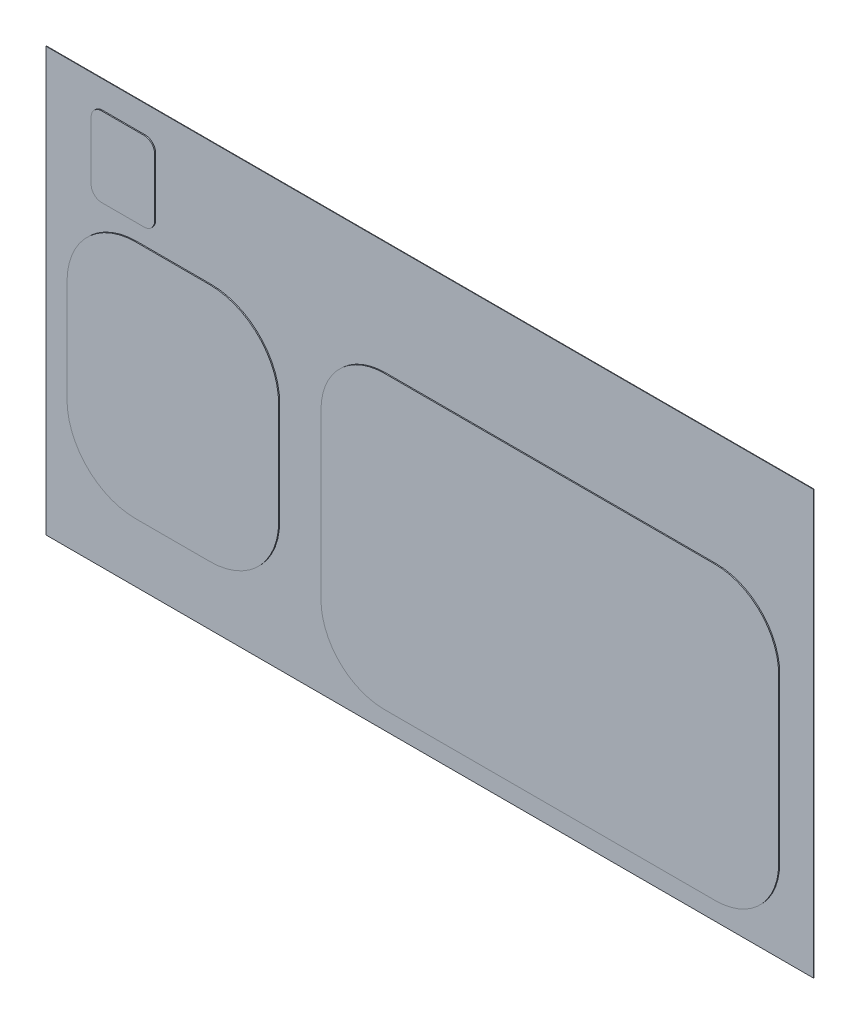
ISO-10303-21;
HEADER;
FILE_DESCRIPTION(('STEP AP214'),'2;1');
FILE_NAME('part.step','',(''),(''),'','','');
FILE_SCHEMA(('AUTOMOTIVE_DESIGN { 1 0 10303 214 1 1 1 1 }'));
ENDSEC;
DATA;
#1=APPLICATION_CONTEXT('core data for automotive mechanical design processes');
#2=APPLICATION_PROTOCOL_DEFINITION('international standard','automotive_design',2000,#1);
#3=PRODUCT_CONTEXT('',#1,'mechanical');
#4=PRODUCT('Part','Part','',(#3));
#5=PRODUCT_RELATED_PRODUCT_CATEGORY('part','',(#4));
#6=PRODUCT_DEFINITION_FORMATION('','',#4);
#7=PRODUCT_DEFINITION_CONTEXT('part definition',#1,'design');
#8=PRODUCT_DEFINITION('design','',#6,#7);
#9=PRODUCT_DEFINITION_SHAPE('','',#8);
#10=(LENGTH_UNIT() NAMED_UNIT(*) SI_UNIT(.MILLI.,.METRE.));
#11=(NAMED_UNIT(*) PLANE_ANGLE_UNIT() SI_UNIT($,.RADIAN.));
#12=(NAMED_UNIT(*) SI_UNIT($,.STERADIAN.) SOLID_ANGLE_UNIT());
#13=UNCERTAINTY_MEASURE_WITH_UNIT(LENGTH_MEASURE(1.E-05),#10,'distance_accuracy_value','');
#14=(GEOMETRIC_REPRESENTATION_CONTEXT(3) GLOBAL_UNCERTAINTY_ASSIGNED_CONTEXT((#13)) GLOBAL_UNIT_ASSIGNED_CONTEXT((#10,
#11,#12)) REPRESENTATION_CONTEXT('',''));
#15=CARTESIAN_POINT('',(0.,0.,0.));
#16=DIRECTION('',(0.,0.,1.));
#17=DIRECTION('',(1.,0.,0.));
#18=AXIS2_PLACEMENT_3D('',#15,#16,#17);
#19=CARTESIAN_POINT('',(130000.,-12500.,-300.));
#20=DIRECTION('',(1.,0.,0.));
#21=DIRECTION('',(0.,0.,-1.));
#22=AXIS2_PLACEMENT_3D('',#19,#20,#21);
#23=PLANE('',#22);
#24=DIRECTION('',(0.,0.,1.));
#25=VECTOR('',#24,1.);
#26=CARTESIAN_POINT('',(130000.,67500.,-300.));
#27=LINE('',#26,#25);
#28=CARTESIAN_POINT('',(130000.,67500.,-300.));
#29=VERTEX_POINT('',#28);
#30=CARTESIAN_POINT('',(130000.,67500.,-200.));
#31=VERTEX_POINT('',#30);
#32=EDGE_CURVE('E439',#29,#31,#27,.T.);
#33=ORIENTED_EDGE('',*,*,#32,.T.);
#34=DIRECTION('',(0.,-1.,0.));
#35=VECTOR('',#34,1.);
#36=CARTESIAN_POINT('',(130000.,-12500.,-200.));
#37=LINE('',#36,#35);
#38=CARTESIAN_POINT('',(130000.,-12500.,-200.));
#39=VERTEX_POINT('',#38);
#40=EDGE_CURVE('E46',#31,#39,#37,.T.);
#41=ORIENTED_EDGE('',*,*,#40,.T.);
#42=DIRECTION('',(0.,0.,1.));
#43=VECTOR('',#42,1.);
#44=CARTESIAN_POINT('',(130000.,-12500.,-300.));
#45=LINE('',#44,#43);
#46=CARTESIAN_POINT('',(130000.,-12500.,-300.));
#47=VERTEX_POINT('',#46);
#48=EDGE_CURVE('E39',#47,#39,#45,.T.);
#49=ORIENTED_EDGE('',*,*,#48,.F.);
#50=DIRECTION('',(0.,1.,0.));
#51=VECTOR('',#50,1.);
#52=CARTESIAN_POINT('',(130000.,-12500.,-300.));
#53=LINE('',#52,#51);
#54=EDGE_CURVE('E427',#47,#29,#53,.T.);
#55=ORIENTED_EDGE('',*,*,#54,.T.);
#56=EDGE_LOOP('',(#33,#41,#49,#55));
#57=FACE_BOUND('',#56,.T.);
#58=ADVANCED_FACE('F32',(#57),#23,.T.);
#59=CARTESIAN_POINT('',(130000.,-12500.,-300.));
#60=DIRECTION('',(0.,-1.,0.));
#61=DIRECTION('',(1.,0.,0.));
#62=AXIS2_PLACEMENT_3D('',#59,#60,#61);
#63=PLANE('',#62);
#64=ORIENTED_EDGE('',*,*,#48,.T.);
#65=DIRECTION('',(-1.,0.,0.));
#66=VECTOR('',#65,1.);
#67=CARTESIAN_POINT('',(130000.,-12500.,-200.));
#68=LINE('',#67,#66);
#69=CARTESIAN_POINT('',(-15000.,-12500.,-200.));
#70=VERTEX_POINT('',#69);
#71=EDGE_CURVE('E423',#39,#70,#68,.T.);
#72=ORIENTED_EDGE('',*,*,#71,.T.);
#73=DIRECTION('',(0.,0.,1.));
#74=VECTOR('',#73,1.);
#75=CARTESIAN_POINT('',(-15000.,-12500.,-300.));
#76=LINE('',#75,#74);
#77=CARTESIAN_POINT('',(-15000.,-12500.,-300.));
#78=VERTEX_POINT('',#77);
#79=EDGE_CURVE('E442',#78,#70,#76,.T.);
#80=ORIENTED_EDGE('',*,*,#79,.F.);
#81=DIRECTION('',(1.,0.,0.));
#82=VECTOR('',#81,1.);
#83=CARTESIAN_POINT('',(130000.,-12500.,-300.));
#84=LINE('',#83,#82);
#85=EDGE_CURVE('E436',#78,#47,#84,.T.);
#86=ORIENTED_EDGE('',*,*,#85,.T.);
#87=EDGE_LOOP('',(#64,#72,#80,#86));
#88=FACE_BOUND('',#87,.T.);
#89=ADVANCED_FACE('F460',(#88),#63,.T.);
#90=CARTESIAN_POINT('',(-15000.,-12500.,-300.));
#91=DIRECTION('',(-1.,0.,0.));
#92=DIRECTION('',(0.,0.,1.));
#93=AXIS2_PLACEMENT_3D('',#90,#91,#92);
#94=PLANE('',#93);
#95=ORIENTED_EDGE('',*,*,#79,.T.);
#96=DIRECTION('',(0.,1.,0.));
#97=VECTOR('',#96,1.);
#98=CARTESIAN_POINT('',(-15000.,-12500.,-200.));
#99=LINE('',#98,#97);
#100=CARTESIAN_POINT('',(-15000.,67500.,-200.));
#101=VERTEX_POINT('',#100);
#102=EDGE_CURVE('E407',#70,#101,#99,.T.);
#103=ORIENTED_EDGE('',*,*,#102,.T.);
#104=DIRECTION('',(0.,0.,1.));
#105=VECTOR('',#104,1.);
#106=CARTESIAN_POINT('',(-15000.,67500.,-300.));
#107=LINE('',#106,#105);
#108=CARTESIAN_POINT('',(-15000.,67500.,-300.));
#109=VERTEX_POINT('',#108);
#110=EDGE_CURVE('E445',#109,#101,#107,.T.);
#111=ORIENTED_EDGE('',*,*,#110,.F.);
#112=DIRECTION('',(0.,-1.,0.));
#113=VECTOR('',#112,1.);
#114=CARTESIAN_POINT('',(-15000.,-12500.,-300.));
#115=LINE('',#114,#113);
#116=EDGE_CURVE('E433',#109,#78,#115,.T.);
#117=ORIENTED_EDGE('',*,*,#116,.T.);
#118=EDGE_LOOP('',(#95,#103,#111,#117));
#119=FACE_BOUND('',#118,.T.);
#120=ADVANCED_FACE('F458',(#119),#94,.T.);
#121=CARTESIAN_POINT('',(130000.,67500.,-300.));
#122=DIRECTION('',(0.,1.,0.));
#123=DIRECTION('',(-1.,0.,0.));
#124=AXIS2_PLACEMENT_3D('',#121,#122,#123);
#125=PLANE('',#124);
#126=ORIENTED_EDGE('',*,*,#110,.T.);
#127=DIRECTION('',(1.,0.,0.));
#128=VECTOR('',#127,1.);
#129=CARTESIAN_POINT('',(130000.,67500.,-200.));
#130=LINE('',#129,#128);
#131=EDGE_CURVE('E12',#101,#31,#130,.T.);
#132=ORIENTED_EDGE('',*,*,#131,.T.);
#133=ORIENTED_EDGE('',*,*,#32,.F.);
#134=DIRECTION('',(-1.,0.,0.));
#135=VECTOR('',#134,1.);
#136=CARTESIAN_POINT('',(130000.,67500.,-300.));
#137=LINE('',#136,#135);
#138=EDGE_CURVE('E430',#29,#109,#137,.T.);
#139=ORIENTED_EDGE('',*,*,#138,.T.);
#140=EDGE_LOOP('',(#126,#132,#133,#139));
#141=FACE_BOUND('',#140,.T.);
#142=ADVANCED_FACE('F452',(#141),#125,.T.);
#143=CARTESIAN_POINT('',(130000.,67500.,-300.));
#144=DIRECTION('',(0.,0.,1.));
#145=DIRECTION('',(1.,0.,0.));
#146=AXIS2_PLACEMENT_3D('',#143,#144,#145);
#147=PLANE('',#146);
#148=ORIENTED_EDGE('',*,*,#54,.F.);
#149=ORIENTED_EDGE('',*,*,#85,.F.);
#150=ORIENTED_EDGE('',*,*,#116,.F.);
#151=ORIENTED_EDGE('',*,*,#138,.F.);
#152=EDGE_LOOP('',(#148,#149,#150,#151));
#153=FACE_BOUND('',#152,.T.);
#154=ADVANCED_FACE('F455',(#153),#147,.F.);
#155=CARTESIAN_POINT('',(57500.,27500.,-200.));
#156=DIRECTION('',(0.,0.,1.));
#157=DIRECTION('',(1.,0.,0.));
#158=AXIS2_PLACEMENT_3D('',#155,#156,#157);
#159=PLANE('',#158);
#160=ORIENTED_EDGE('',*,*,#131,.F.);
#161=ORIENTED_EDGE('',*,*,#102,.F.);
#162=ORIENTED_EDGE('',*,*,#71,.F.);
#163=ORIENTED_EDGE('',*,*,#40,.F.);
#164=EDGE_LOOP('',(#160,#161,#162,#163));
#165=FACE_BOUND('',#164,.T.);
#166=DIRECTION('',(0.,1.,0.));
#167=VECTOR('',#166,1.);
#168=CARTESIAN_POINT('',(29145.0577376786,11839.6336256256,-200.));
#169=LINE('',#168,#167);
#170=CARTESIAN_POINT('',(29145.0577376786,11839.6336256256,-200.));
#171=VERTEX_POINT('',#170);
#172=CARTESIAN_POINT('',(29145.0577376786,31139.6336256256,-200.));
#173=VERTEX_POINT('',#172);
#174=EDGE_CURVE('E228',#171,#173,#169,.T.);
#175=ORIENTED_EDGE('',*,*,#174,.F.);
#176=CARTESIAN_POINT('',(16145.0577376786,11839.6336256256,-200.));
#177=DIRECTION('',(0.,0.,1.));
#178=DIRECTION('',(1.,0.,0.));
#179=AXIS2_PLACEMENT_3D('',#176,#177,#178);
#180=CIRCLE('',#179,13000.);
#181=CARTESIAN_POINT('',(16145.0577376786,-1160.36637437436,-200.));
#182=VERTEX_POINT('',#181);
#183=EDGE_CURVE('E260',#182,#171,#180,.T.);
#184=ORIENTED_EDGE('',*,*,#183,.F.);
#185=DIRECTION('',(1.,0.,0.));
#186=VECTOR('',#185,1.);
#187=CARTESIAN_POINT('',(2145.05773767859,-1160.36637437436,-200.));
#188=LINE('',#187,#186);
#189=CARTESIAN_POINT('',(2145.05773767859,-1160.36637437436,-200.));
#190=VERTEX_POINT('',#189);
#191=EDGE_CURVE('E257',#190,#182,#188,.T.);
#192=ORIENTED_EDGE('',*,*,#191,.F.);
#193=CARTESIAN_POINT('',(2145.05773767859,11839.6336256256,-200.));
#194=DIRECTION('',(0.,0.,1.));
#195=DIRECTION('',(1.,0.,0.));
#196=AXIS2_PLACEMENT_3D('',#193,#194,#195);
#197=CIRCLE('',#196,13000.);
#198=CARTESIAN_POINT('',(-10854.9422623214,11839.6336256256,-200.));
#199=VERTEX_POINT('',#198);
#200=EDGE_CURVE('E254',#199,#190,#197,.T.);
#201=ORIENTED_EDGE('',*,*,#200,.F.);
#202=DIRECTION('',(0.,-1.,0.));
#203=VECTOR('',#202,1.);
#204=CARTESIAN_POINT('',(-10854.9422623214,31139.6336256256,-200.));
#205=LINE('',#204,#203);
#206=CARTESIAN_POINT('',(-10854.9422623214,31139.6336256256,-200.));
#207=VERTEX_POINT('',#206);
#208=EDGE_CURVE('E251',#207,#199,#205,.T.);
#209=ORIENTED_EDGE('',*,*,#208,.F.);
#210=CARTESIAN_POINT('',(2145.05773767859,31139.6336256256,-200.));
#211=DIRECTION('',(0.,0.,1.));
#212=DIRECTION('',(1.,0.,0.));
#213=AXIS2_PLACEMENT_3D('',#210,#211,#212);
#214=CIRCLE('',#213,13000.);
#215=CARTESIAN_POINT('',(2145.05773767858,44139.6336256256,-200.));
#216=VERTEX_POINT('',#215);
#217=EDGE_CURVE('E239',#216,#207,#214,.T.);
#218=ORIENTED_EDGE('',*,*,#217,.F.);
#219=DIRECTION('',(-1.,0.,0.));
#220=VECTOR('',#219,1.);
#221=CARTESIAN_POINT('',(16145.0577376786,44139.6336256256,-200.));
#222=LINE('',#221,#220);
#223=CARTESIAN_POINT('',(16145.0577376786,44139.6336256256,-200.));
#224=VERTEX_POINT('',#223);
#225=EDGE_CURVE('E220',#224,#216,#222,.T.);
#226=ORIENTED_EDGE('',*,*,#225,.F.);
#227=CARTESIAN_POINT('',(16145.0577376786,31139.6336256256,-200.));
#228=DIRECTION('',(0.,0.,1.));
#229=DIRECTION('',(1.,0.,0.));
#230=AXIS2_PLACEMENT_3D('',#227,#228,#229);
#231=CIRCLE('',#230,13000.);
#232=EDGE_CURVE('E235',#173,#224,#231,.T.);
#233=ORIENTED_EDGE('',*,*,#232,.F.);
#234=EDGE_LOOP('',(#175,#184,#192,#201,#209,#218,#226,#233));
#235=FACE_BOUND('',#234,.T.);
#236=DIRECTION('',(-1.,0.,0.));
#237=VECTOR('',#236,1.);
#238=CARTESIAN_POINT('',(111645.057737679,46139.6336256256,-200.));
#239=LINE('',#238,#237);
#240=CARTESIAN_POINT('',(111645.057737679,46139.6336256256,-200.));
#241=VERTEX_POINT('',#240);
#242=CARTESIAN_POINT('',(49145.0577376786,46139.6336256256,-200.));
#243=VERTEX_POINT('',#242);
#244=EDGE_CURVE('E316',#241,#243,#239,.T.);
#245=ORIENTED_EDGE('',*,*,#244,.F.);
#246=CARTESIAN_POINT('',(111645.057737679,34139.6336256256,-200.));
#247=DIRECTION('',(0.,0.,1.));
#248=DIRECTION('',(1.,0.,0.));
#249=AXIS2_PLACEMENT_3D('',#246,#247,#248);
#250=CIRCLE('',#249,12000.);
#251=CARTESIAN_POINT('',(123645.057737679,34139.6336256256,-200.));
#252=VERTEX_POINT('',#251);
#253=EDGE_CURVE('E313',#252,#241,#250,.T.);
#254=ORIENTED_EDGE('',*,*,#253,.F.);
#255=DIRECTION('',(0.,1.,0.));
#256=VECTOR('',#255,1.);
#257=CARTESIAN_POINT('',(123645.057737679,3109.63362562563,-200.));
#258=LINE('',#257,#256);
#259=CARTESIAN_POINT('',(123645.057737679,3109.63362562563,-200.));
#260=VERTEX_POINT('',#259);
#261=EDGE_CURVE('E310',#260,#252,#258,.T.);
#262=ORIENTED_EDGE('',*,*,#261,.F.);
#263=CARTESIAN_POINT('',(111645.057737679,3109.63362562563,-200.));
#264=DIRECTION('',(0.,0.,1.));
#265=DIRECTION('',(1.,0.,0.));
#266=AXIS2_PLACEMENT_3D('',#263,#264,#265);
#267=CIRCLE('',#266,12000.);
#268=CARTESIAN_POINT('',(111645.057737679,-8890.36637437437,-200.));
#269=VERTEX_POINT('',#268);
#270=EDGE_CURVE('E307',#269,#260,#267,.T.);
#271=ORIENTED_EDGE('',*,*,#270,.F.);
#272=DIRECTION('',(1.,0.,0.));
#273=VECTOR('',#272,1.);
#274=CARTESIAN_POINT('',(49145.0577376786,-8890.36637437438,-200.));
#275=LINE('',#274,#273);
#276=CARTESIAN_POINT('',(49145.0577376786,-8890.36637437438,-200.));
#277=VERTEX_POINT('',#276);
#278=EDGE_CURVE('E304',#277,#269,#275,.T.);
#279=ORIENTED_EDGE('',*,*,#278,.F.);
#280=CARTESIAN_POINT('',(49145.0577376786,3109.63362562563,-200.));
#281=DIRECTION('',(0.,0.,1.));
#282=DIRECTION('',(1.,0.,0.));
#283=AXIS2_PLACEMENT_3D('',#280,#281,#282);
#284=CIRCLE('',#283,12000.);
#285=CARTESIAN_POINT('',(37145.0577376786,3109.63362562563,-200.));
#286=VERTEX_POINT('',#285);
#287=EDGE_CURVE('E301',#286,#277,#284,.T.);
#288=ORIENTED_EDGE('',*,*,#287,.F.);
#289=DIRECTION('',(0.,-1.,0.));
#290=VECTOR('',#289,1.);
#291=CARTESIAN_POINT('',(37145.0577376786,34139.6336256256,-200.));
#292=LINE('',#291,#290);
#293=CARTESIAN_POINT('',(37145.0577376786,34139.6336256256,-200.));
#294=VERTEX_POINT('',#293);
#295=EDGE_CURVE('E297',#294,#286,#292,.T.);
#296=ORIENTED_EDGE('',*,*,#295,.F.);
#297=CARTESIAN_POINT('',(49145.0577376786,34139.6336256256,-200.));
#298=DIRECTION('',(0.,0.,1.));
#299=DIRECTION('',(1.,0.,0.));
#300=AXIS2_PLACEMENT_3D('',#297,#298,#299);
#301=CIRCLE('',#300,12000.);
#302=EDGE_CURVE('E294',#243,#294,#301,.T.);
#303=ORIENTED_EDGE('',*,*,#302,.F.);
#304=EDGE_LOOP('',(#245,#254,#262,#271,#279,#288,#296,#303));
#305=FACE_BOUND('',#304,.T.);
#306=DIRECTION('',(0.,-1.,0.));
#307=VECTOR('',#306,1.);
#308=CARTESIAN_POINT('',(-6301.00045740075,60369.7276507075,-200.));
#309=LINE('',#308,#307);
#310=CARTESIAN_POINT('',(-6301.00045740075,60369.7276507075,-200.));
#311=VERTEX_POINT('',#310);
#312=CARTESIAN_POINT('',(-6301.00045740075,49369.7276507075,-200.));
#313=VERTEX_POINT('',#312);
#314=EDGE_CURVE('E381',#311,#313,#309,.T.);
#315=ORIENTED_EDGE('',*,*,#314,.F.);
#316=CARTESIAN_POINT('',(-4301.00045740075,60369.7276507075,-200.));
#317=DIRECTION('',(0.,0.,1.));
#318=DIRECTION('',(1.,0.,0.));
#319=AXIS2_PLACEMENT_3D('',#316,#317,#318);
#320=CIRCLE('',#319,2000.);
#321=CARTESIAN_POINT('',(-4301.00045740075,62369.7276507075,-200.));
#322=VERTEX_POINT('',#321);
#323=EDGE_CURVE('E378',#322,#311,#320,.T.);
#324=ORIENTED_EDGE('',*,*,#323,.F.);
#325=DIRECTION('',(-1.,0.,0.));
#326=VECTOR('',#325,1.);
#327=CARTESIAN_POINT('',(3698.99954259925,62369.7276507075,-200.));
#328=LINE('',#327,#326);
#329=CARTESIAN_POINT('',(3698.99954259925,62369.7276507075,-200.));
#330=VERTEX_POINT('',#329);
#331=EDGE_CURVE('E375',#330,#322,#328,.T.);
#332=ORIENTED_EDGE('',*,*,#331,.F.);
#333=CARTESIAN_POINT('',(3698.99954259925,60369.7276507075,-200.));
#334=DIRECTION('',(0.,0.,1.));
#335=DIRECTION('',(1.,0.,0.));
#336=AXIS2_PLACEMENT_3D('',#333,#334,#335);
#337=CIRCLE('',#336,2000.);
#338=CARTESIAN_POINT('',(5698.99954259925,60369.7276507075,-200.));
#339=VERTEX_POINT('',#338);
#340=EDGE_CURVE('E372',#339,#330,#337,.T.);
#341=ORIENTED_EDGE('',*,*,#340,.F.);
#342=DIRECTION('',(0.,1.,0.));
#343=VECTOR('',#342,1.);
#344=CARTESIAN_POINT('',(5698.99954259925,49369.7276507075,-200.));
#345=LINE('',#344,#343);
#346=CARTESIAN_POINT('',(5698.99954259925,49369.7276507075,-200.));
#347=VERTEX_POINT('',#346);
#348=EDGE_CURVE('E369',#347,#339,#345,.T.);
#349=ORIENTED_EDGE('',*,*,#348,.F.);
#350=CARTESIAN_POINT('',(3698.99954259925,49369.7276507075,-200.));
#351=DIRECTION('',(0.,0.,1.));
#352=DIRECTION('',(1.,0.,0.));
#353=AXIS2_PLACEMENT_3D('',#350,#351,#352);
#354=CIRCLE('',#353,2000.00000000001);
#355=CARTESIAN_POINT('',(3698.99954259925,47369.7276507075,-200.));
#356=VERTEX_POINT('',#355);
#357=EDGE_CURVE('E366',#356,#347,#354,.T.);
#358=ORIENTED_EDGE('',*,*,#357,.F.);
#359=DIRECTION('',(1.,0.,0.));
#360=VECTOR('',#359,1.);
#361=CARTESIAN_POINT('',(-4301.00045740075,47369.7276507075,-200.));
#362=LINE('',#361,#360);
#363=CARTESIAN_POINT('',(-4301.00045740075,47369.7276507075,-200.));
#364=VERTEX_POINT('',#363);
#365=EDGE_CURVE('E362',#364,#356,#362,.T.);
#366=ORIENTED_EDGE('',*,*,#365,.F.);
#367=CARTESIAN_POINT('',(-4301.00045740075,49369.7276507075,-200.));
#368=DIRECTION('',(0.,0.,1.));
#369=DIRECTION('',(1.,0.,0.));
#370=AXIS2_PLACEMENT_3D('',#367,#368,#369);
#371=CIRCLE('',#370,2000.);
#372=EDGE_CURVE('E359',#313,#364,#371,.T.);
#373=ORIENTED_EDGE('',*,*,#372,.F.);
#374=EDGE_LOOP('',(#315,#324,#332,#341,#349,#358,#366,#373));
#375=FACE_BOUND('',#374,.T.);
#376=ADVANCED_FACE('F233',(#165,#235,#305,#375),#159,.T.);
#377=CARTESIAN_POINT('',(-4301.00045740075,49369.7276507075,-200.));
#378=DIRECTION('',(0.,0.,1.));
#379=DIRECTION('',(1.,0.,0.));
#380=AXIS2_PLACEMENT_3D('',#377,#378,#379);
#381=CYLINDRICAL_SURFACE('',#380,2000.);
#382=CARTESIAN_POINT('',(-4301.00045740075,49369.7276507075,0.));
#383=DIRECTION('',(0.,0.,1.));
#384=DIRECTION('',(1.,0.,0.));
#385=AXIS2_PLACEMENT_3D('',#382,#383,#384);
#386=CIRCLE('',#385,2000.);
#387=CARTESIAN_POINT('',(-6301.00045740075,49369.7276507075,0.));
#388=VERTEX_POINT('',#387);
#389=CARTESIAN_POINT('',(-4301.00045740075,47369.7276507075,0.));
#390=VERTEX_POINT('',#389);
#391=EDGE_CURVE('E344',#388,#390,#386,.T.);
#392=ORIENTED_EDGE('',*,*,#391,.F.);
#393=DIRECTION('',(0.,0.,1.));
#394=VECTOR('',#393,1.);
#395=CARTESIAN_POINT('',(-6301.00045740075,49369.7276507075,-200.));
#396=LINE('',#395,#394);
#397=EDGE_CURVE('E405',#313,#388,#396,.T.);
#398=ORIENTED_EDGE('',*,*,#397,.F.);
#399=ORIENTED_EDGE('',*,*,#372,.T.);
#400=DIRECTION('',(0.,0.,1.));
#401=VECTOR('',#400,1.);
#402=CARTESIAN_POINT('',(-4301.00045740075,47369.7276507075,-200.));
#403=LINE('',#402,#401);
#404=EDGE_CURVE('E384',#364,#390,#403,.T.);
#405=ORIENTED_EDGE('',*,*,#404,.T.);
#406=EDGE_LOOP('',(#392,#398,#399,#405));
#407=FACE_BOUND('',#406,.T.);
#408=ADVANCED_FACE('F478',(#407),#381,.T.);
#409=CARTESIAN_POINT('',(-6301.00045740075,60369.7276507075,-200.));
#410=DIRECTION('',(-1.,0.,0.));
#411=DIRECTION('',(0.,-1.,0.));
#412=AXIS2_PLACEMENT_3D('',#409,#410,#411);
#413=PLANE('',#412);
#414=DIRECTION('',(0.,-1.,0.));
#415=VECTOR('',#414,1.);
#416=CARTESIAN_POINT('',(-6301.00045740075,60369.7276507075,0.));
#417=LINE('',#416,#415);
#418=CARTESIAN_POINT('',(-6301.00045740075,60369.7276507075,0.));
#419=VERTEX_POINT('',#418);
#420=EDGE_CURVE('E363',#419,#388,#417,.T.);
#421=ORIENTED_EDGE('',*,*,#420,.F.);
#422=DIRECTION('',(0.,0.,1.));
#423=VECTOR('',#422,1.);
#424=CARTESIAN_POINT('',(-6301.00045740075,60369.7276507075,-200.));
#425=LINE('',#424,#423);
#426=EDGE_CURVE('E408',#311,#419,#425,.T.);
#427=ORIENTED_EDGE('',*,*,#426,.F.);
#428=ORIENTED_EDGE('',*,*,#314,.T.);
#429=ORIENTED_EDGE('',*,*,#397,.T.);
#430=EDGE_LOOP('',(#421,#427,#428,#429));
#431=FACE_BOUND('',#430,.T.);
#432=ADVANCED_FACE('F483',(#431),#413,.T.);
#433=CARTESIAN_POINT('',(-4301.00045740075,60369.7276507075,-200.));
#434=DIRECTION('',(0.,0.,1.));
#435=DIRECTION('',(1.,0.,0.));
#436=AXIS2_PLACEMENT_3D('',#433,#434,#435);
#437=CYLINDRICAL_SURFACE('',#436,2000.);
#438=CARTESIAN_POINT('',(-4301.00045740075,60369.7276507075,0.));
#439=DIRECTION('',(0.,0.,1.));
#440=DIRECTION('',(1.,0.,0.));
#441=AXIS2_PLACEMENT_3D('',#438,#439,#440);
#442=CIRCLE('',#441,2000.);
#443=CARTESIAN_POINT('',(-4301.00045740075,62369.7276507075,0.));
#444=VERTEX_POINT('',#443);
#445=EDGE_CURVE('E400',#444,#419,#442,.T.);
#446=ORIENTED_EDGE('',*,*,#445,.F.);
#447=DIRECTION('',(0.,0.,1.));
#448=VECTOR('',#447,1.);
#449=CARTESIAN_POINT('',(-4301.00045740075,62369.7276507075,-200.));
#450=LINE('',#449,#448);
#451=EDGE_CURVE('E410',#322,#444,#450,.T.);
#452=ORIENTED_EDGE('',*,*,#451,.F.);
#453=ORIENTED_EDGE('',*,*,#323,.T.);
#454=ORIENTED_EDGE('',*,*,#426,.T.);
#455=EDGE_LOOP('',(#446,#452,#453,#454));
#456=FACE_BOUND('',#455,.T.);
#457=ADVANCED_FACE('F504',(#456),#437,.T.);
#458=CARTESIAN_POINT('',(3698.99954259925,62369.7276507075,-200.));
#459=DIRECTION('',(0.,1.,0.));
#460=DIRECTION('',(0.,0.,1.));
#461=AXIS2_PLACEMENT_3D('',#458,#459,#460);
#462=PLANE('',#461);
#463=DIRECTION('',(-1.,0.,0.));
#464=VECTOR('',#463,1.);
#465=CARTESIAN_POINT('',(3698.99954259925,62369.7276507075,0.));
#466=LINE('',#465,#464);
#467=CARTESIAN_POINT('',(3698.99954259925,62369.7276507075,0.));
#468=VERTEX_POINT('',#467);
#469=EDGE_CURVE('E397',#468,#444,#466,.T.);
#470=ORIENTED_EDGE('',*,*,#469,.F.);
#471=DIRECTION('',(0.,0.,1.));
#472=VECTOR('',#471,1.);
#473=CARTESIAN_POINT('',(3698.99954259925,62369.7276507075,-200.));
#474=LINE('',#473,#472);
#475=EDGE_CURVE('E412',#330,#468,#474,.T.);
#476=ORIENTED_EDGE('',*,*,#475,.F.);
#477=ORIENTED_EDGE('',*,*,#331,.T.);
#478=ORIENTED_EDGE('',*,*,#451,.T.);
#479=EDGE_LOOP('',(#470,#476,#477,#478));
#480=FACE_BOUND('',#479,.T.);
#481=ADVANCED_FACE('F500',(#480),#462,.T.);
#482=CARTESIAN_POINT('',(3698.99954259925,60369.7276507075,-200.));
#483=DIRECTION('',(0.,0.,1.));
#484=DIRECTION('',(1.,0.,0.));
#485=AXIS2_PLACEMENT_3D('',#482,#483,#484);
#486=CYLINDRICAL_SURFACE('',#485,2000.);
#487=CARTESIAN_POINT('',(3698.99954259925,60369.7276507075,0.));
#488=DIRECTION('',(0.,0.,1.));
#489=DIRECTION('',(1.,0.,0.));
#490=AXIS2_PLACEMENT_3D('',#487,#488,#489);
#491=CIRCLE('',#490,2000.);
#492=CARTESIAN_POINT('',(5698.99954259925,60369.7276507075,0.));
#493=VERTEX_POINT('',#492);
#494=EDGE_CURVE('E394',#493,#468,#491,.T.);
#495=ORIENTED_EDGE('',*,*,#494,.F.);
#496=DIRECTION('',(0.,0.,1.));
#497=VECTOR('',#496,1.);
#498=CARTESIAN_POINT('',(5698.99954259925,60369.7276507075,-200.));
#499=LINE('',#498,#497);
#500=EDGE_CURVE('E414',#339,#493,#499,.T.);
#501=ORIENTED_EDGE('',*,*,#500,.F.);
#502=ORIENTED_EDGE('',*,*,#340,.T.);
#503=ORIENTED_EDGE('',*,*,#475,.T.);
#504=EDGE_LOOP('',(#495,#501,#502,#503));
#505=FACE_BOUND('',#504,.T.);
#506=ADVANCED_FACE('F496',(#505),#486,.T.);
#507=CARTESIAN_POINT('',(5698.99954259925,49369.7276507075,-200.));
#508=DIRECTION('',(1.,0.,0.));
#509=DIRECTION('',(0.,1.,0.));
#510=AXIS2_PLACEMENT_3D('',#507,#508,#509);
#511=PLANE('',#510);
#512=DIRECTION('',(0.,1.,0.));
#513=VECTOR('',#512,1.);
#514=CARTESIAN_POINT('',(5698.99954259925,49369.7276507075,0.));
#515=LINE('',#514,#513);
#516=CARTESIAN_POINT('',(5698.99954259925,49369.7276507075,0.));
#517=VERTEX_POINT('',#516);
#518=EDGE_CURVE('E391',#517,#493,#515,.T.);
#519=ORIENTED_EDGE('',*,*,#518,.F.);
#520=DIRECTION('',(0.,0.,1.));
#521=VECTOR('',#520,1.);
#522=CARTESIAN_POINT('',(5698.99954259925,49369.7276507075,-200.));
#523=LINE('',#522,#521);
#524=EDGE_CURVE('E416',#347,#517,#523,.T.);
#525=ORIENTED_EDGE('',*,*,#524,.F.);
#526=ORIENTED_EDGE('',*,*,#348,.T.);
#527=ORIENTED_EDGE('',*,*,#500,.T.);
#528=EDGE_LOOP('',(#519,#525,#526,#527));
#529=FACE_BOUND('',#528,.T.);
#530=ADVANCED_FACE('F493',(#529),#511,.T.);
#531=CARTESIAN_POINT('',(3698.99954259925,49369.7276507075,-200.));
#532=DIRECTION('',(0.,0.,1.));
#533=DIRECTION('',(1.,0.,0.));
#534=AXIS2_PLACEMENT_3D('',#531,#532,#533);
#535=CYLINDRICAL_SURFACE('',#534,2000.00000000001);
#536=CARTESIAN_POINT('',(3698.99954259925,49369.7276507075,0.));
#537=DIRECTION('',(0.,0.,1.));
#538=DIRECTION('',(1.,0.,0.));
#539=AXIS2_PLACEMENT_3D('',#536,#537,#538);
#540=CIRCLE('',#539,2000.00000000001);
#541=CARTESIAN_POINT('',(3698.99954259925,47369.7276507075,0.));
#542=VERTEX_POINT('',#541);
#543=EDGE_CURVE('E53',#542,#517,#540,.T.);
#544=ORIENTED_EDGE('',*,*,#543,.F.);
#545=DIRECTION('',(0.,0.,1.));
#546=VECTOR('',#545,1.);
#547=CARTESIAN_POINT('',(3698.99954259925,47369.7276507075,-200.));
#548=LINE('',#547,#546);
#549=EDGE_CURVE('E418',#356,#542,#548,.T.);
#550=ORIENTED_EDGE('',*,*,#549,.F.);
#551=ORIENTED_EDGE('',*,*,#357,.T.);
#552=ORIENTED_EDGE('',*,*,#524,.T.);
#553=EDGE_LOOP('',(#544,#550,#551,#552));
#554=FACE_BOUND('',#553,.T.);
#555=ADVANCED_FACE('F489',(#554),#535,.T.);
#556=CARTESIAN_POINT('',(-4301.00045740075,47369.7276507075,-200.));
#557=DIRECTION('',(0.,-1.,0.));
#558=DIRECTION('',(1.,0.,0.));
#559=AXIS2_PLACEMENT_3D('',#556,#557,#558);
#560=PLANE('',#559);
#561=DIRECTION('',(1.,0.,0.));
#562=VECTOR('',#561,1.);
#563=CARTESIAN_POINT('',(-4301.00045740075,47369.7276507075,0.));
#564=LINE('',#563,#562);
#565=EDGE_CURVE('E387',#390,#542,#564,.T.);
#566=ORIENTED_EDGE('',*,*,#565,.F.);
#567=ORIENTED_EDGE('',*,*,#404,.F.);
#568=ORIENTED_EDGE('',*,*,#365,.T.);
#569=ORIENTED_EDGE('',*,*,#549,.T.);
#570=EDGE_LOOP('',(#566,#567,#568,#569));
#571=FACE_BOUND('',#570,.T.);
#572=ADVANCED_FACE('F485',(#571),#560,.T.);
#573=CARTESIAN_POINT('',(49145.0577376786,34139.6336256256,-200.));
#574=DIRECTION('',(0.,0.,1.));
#575=DIRECTION('',(1.,0.,0.));
#576=AXIS2_PLACEMENT_3D('',#573,#574,#575);
#577=CYLINDRICAL_SURFACE('',#576,12000.);
#578=CARTESIAN_POINT('',(49145.0577376786,34139.6336256256,0.));
#579=DIRECTION('',(0.,0.,1.));
#580=DIRECTION('',(1.,0.,0.));
#581=AXIS2_PLACEMENT_3D('',#578,#579,#580);
#582=CIRCLE('',#581,12000.);
#583=CARTESIAN_POINT('',(49145.0577376786,46139.6336256256,0.));
#584=VERTEX_POINT('',#583);
#585=CARTESIAN_POINT('',(37145.0577376786,34139.6336256256,0.));
#586=VERTEX_POINT('',#585);
#587=EDGE_CURVE('E282',#584,#586,#582,.T.);
#588=ORIENTED_EDGE('',*,*,#587,.F.);
#589=DIRECTION('',(0.,0.,1.));
#590=VECTOR('',#589,1.);
#591=CARTESIAN_POINT('',(49145.0577376786,46139.6336256256,-200.));
#592=LINE('',#591,#590);
#593=EDGE_CURVE('E342',#243,#584,#592,.T.);
#594=ORIENTED_EDGE('',*,*,#593,.F.);
#595=ORIENTED_EDGE('',*,*,#302,.T.);
#596=DIRECTION('',(0.,0.,1.));
#597=VECTOR('',#596,1.);
#598=CARTESIAN_POINT('',(37145.0577376786,34139.6336256256,-200.));
#599=LINE('',#598,#597);
#600=EDGE_CURVE('E319',#294,#586,#599,.T.);
#601=ORIENTED_EDGE('',*,*,#600,.T.);
#602=EDGE_LOOP('',(#588,#594,#595,#601));
#603=FACE_BOUND('',#602,.T.);
#604=ADVANCED_FACE('F488',(#603),#577,.T.);
#605=CARTESIAN_POINT('',(111645.057737679,46139.6336256256,-200.));
#606=DIRECTION('',(0.,1.,0.));
#607=DIRECTION('',(0.,0.,1.));
#608=AXIS2_PLACEMENT_3D('',#605,#606,#607);
#609=PLANE('',#608);
#610=DIRECTION('',(-1.,0.,0.));
#611=VECTOR('',#610,1.);
#612=CARTESIAN_POINT('',(111645.057737679,46139.6336256256,0.));
#613=LINE('',#612,#611);
#614=CARTESIAN_POINT('',(111645.057737679,46139.6336256256,0.));
#615=VERTEX_POINT('',#614);
#616=EDGE_CURVE('E298',#615,#584,#613,.T.);
#617=ORIENTED_EDGE('',*,*,#616,.F.);
#618=DIRECTION('',(0.,0.,1.));
#619=VECTOR('',#618,1.);
#620=CARTESIAN_POINT('',(111645.057737679,46139.6336256256,-200.));
#621=LINE('',#620,#619);
#622=EDGE_CURVE('E345',#241,#615,#621,.T.);
#623=ORIENTED_EDGE('',*,*,#622,.F.);
#624=ORIENTED_EDGE('',*,*,#244,.T.);
#625=ORIENTED_EDGE('',*,*,#593,.T.);
#626=EDGE_LOOP('',(#617,#623,#624,#625));
#627=FACE_BOUND('',#626,.T.);
#628=ADVANCED_FACE('F514',(#627),#609,.T.);
#629=CARTESIAN_POINT('',(111645.057737679,34139.6336256256,-200.));
#630=DIRECTION('',(0.,0.,1.));
#631=DIRECTION('',(1.,0.,0.));
#632=AXIS2_PLACEMENT_3D('',#629,#630,#631);
#633=CYLINDRICAL_SURFACE('',#632,12000.);
#634=CARTESIAN_POINT('',(111645.057737679,34139.6336256256,0.));
#635=DIRECTION('',(0.,0.,1.));
#636=DIRECTION('',(1.,0.,0.));
#637=AXIS2_PLACEMENT_3D('',#634,#635,#636);
#638=CIRCLE('',#637,12000.);
#639=CARTESIAN_POINT('',(123645.057737679,34139.6336256256,0.));
#640=VERTEX_POINT('',#639);
#641=EDGE_CURVE('E337',#640,#615,#638,.T.);
#642=ORIENTED_EDGE('',*,*,#641,.F.);
#643=DIRECTION('',(0.,0.,1.));
#644=VECTOR('',#643,1.);
#645=CARTESIAN_POINT('',(123645.057737679,34139.6336256256,-200.));
#646=LINE('',#645,#644);
#647=EDGE_CURVE('E347',#252,#640,#646,.T.);
#648=ORIENTED_EDGE('',*,*,#647,.F.);
#649=ORIENTED_EDGE('',*,*,#253,.T.);
#650=ORIENTED_EDGE('',*,*,#622,.T.);
#651=EDGE_LOOP('',(#642,#648,#649,#650));
#652=FACE_BOUND('',#651,.T.);
#653=ADVANCED_FACE('F535',(#652),#633,.T.);
#654=CARTESIAN_POINT('',(123645.057737679,3109.63362562563,-200.));
#655=DIRECTION('',(1.,0.,0.));
#656=DIRECTION('',(0.,1.,0.));
#657=AXIS2_PLACEMENT_3D('',#654,#655,#656);
#658=PLANE('',#657);
#659=DIRECTION('',(0.,1.,0.));
#660=VECTOR('',#659,1.);
#661=CARTESIAN_POINT('',(123645.057737679,3109.63362562563,0.));
#662=LINE('',#661,#660);
#663=CARTESIAN_POINT('',(123645.057737679,3109.63362562563,0.));
#664=VERTEX_POINT('',#663);
#665=EDGE_CURVE('E334',#664,#640,#662,.T.);
#666=ORIENTED_EDGE('',*,*,#665,.F.);
#667=DIRECTION('',(0.,0.,1.));
#668=VECTOR('',#667,1.);
#669=CARTESIAN_POINT('',(123645.057737679,3109.63362562563,-200.));
#670=LINE('',#669,#668);
#671=EDGE_CURVE('E349',#260,#664,#670,.T.);
#672=ORIENTED_EDGE('',*,*,#671,.F.);
#673=ORIENTED_EDGE('',*,*,#261,.T.);
#674=ORIENTED_EDGE('',*,*,#647,.T.);
#675=EDGE_LOOP('',(#666,#672,#673,#674));
#676=FACE_BOUND('',#675,.T.);
#677=ADVANCED_FACE('F531',(#676),#658,.T.);
#678=CARTESIAN_POINT('',(111645.057737679,3109.63362562563,-200.));
#679=DIRECTION('',(0.,0.,1.));
#680=DIRECTION('',(1.,0.,0.));
#681=AXIS2_PLACEMENT_3D('',#678,#679,#680);
#682=CYLINDRICAL_SURFACE('',#681,12000.);
#683=CARTESIAN_POINT('',(111645.057737679,3109.63362562563,0.));
#684=DIRECTION('',(0.,0.,1.));
#685=DIRECTION('',(1.,0.,0.));
#686=AXIS2_PLACEMENT_3D('',#683,#684,#685);
#687=CIRCLE('',#686,12000.);
#688=CARTESIAN_POINT('',(111645.057737679,-8890.36637437437,0.));
#689=VERTEX_POINT('',#688);
#690=EDGE_CURVE('E331',#689,#664,#687,.T.);
#691=ORIENTED_EDGE('',*,*,#690,.F.);
#692=DIRECTION('',(0.,0.,1.));
#693=VECTOR('',#692,1.);
#694=CARTESIAN_POINT('',(111645.057737679,-8890.36637437437,-200.));
#695=LINE('',#694,#693);
#696=EDGE_CURVE('E351',#269,#689,#695,.T.);
#697=ORIENTED_EDGE('',*,*,#696,.F.);
#698=ORIENTED_EDGE('',*,*,#270,.T.);
#699=ORIENTED_EDGE('',*,*,#671,.T.);
#700=EDGE_LOOP('',(#691,#697,#698,#699));
#701=FACE_BOUND('',#700,.T.);
#702=ADVANCED_FACE('F527',(#701),#682,.T.);
#703=CARTESIAN_POINT('',(49145.0577376786,-8890.36637437438,-200.));
#704=DIRECTION('',(0.,-1.,0.));
#705=DIRECTION('',(1.,0.,0.));
#706=AXIS2_PLACEMENT_3D('',#703,#704,#705);
#707=PLANE('',#706);
#708=DIRECTION('',(1.,0.,0.));
#709=VECTOR('',#708,1.);
#710=CARTESIAN_POINT('',(49145.0577376786,-8890.36637437438,0.));
#711=LINE('',#710,#709);
#712=CARTESIAN_POINT('',(49145.0577376786,-8890.36637437438,0.));
#713=VERTEX_POINT('',#712);
#714=EDGE_CURVE('E328',#713,#689,#711,.T.);
#715=ORIENTED_EDGE('',*,*,#714,.F.);
#716=DIRECTION('',(0.,0.,1.));
#717=VECTOR('',#716,1.);
#718=CARTESIAN_POINT('',(49145.0577376786,-8890.36637437438,-200.));
#719=LINE('',#718,#717);
#720=EDGE_CURVE('E353',#277,#713,#719,.T.);
#721=ORIENTED_EDGE('',*,*,#720,.F.);
#722=ORIENTED_EDGE('',*,*,#278,.T.);
#723=ORIENTED_EDGE('',*,*,#696,.T.);
#724=EDGE_LOOP('',(#715,#721,#722,#723));
#725=FACE_BOUND('',#724,.T.);
#726=ADVANCED_FACE('F523',(#725),#707,.T.);
#727=CARTESIAN_POINT('',(49145.0577376786,3109.63362562563,-200.));
#728=DIRECTION('',(0.,0.,1.));
#729=DIRECTION('',(1.,0.,0.));
#730=AXIS2_PLACEMENT_3D('',#727,#728,#729);
#731=CYLINDRICAL_SURFACE('',#730,12000.);
#732=CARTESIAN_POINT('',(49145.0577376786,3109.63362562563,0.));
#733=DIRECTION('',(0.,0.,1.));
#734=DIRECTION('',(1.,0.,0.));
#735=AXIS2_PLACEMENT_3D('',#732,#733,#734);
#736=CIRCLE('',#735,12000.);
#737=CARTESIAN_POINT('',(37145.0577376786,3109.63362562563,0.));
#738=VERTEX_POINT('',#737);
#739=EDGE_CURVE('E325',#738,#713,#736,.T.);
#740=ORIENTED_EDGE('',*,*,#739,.F.);
#741=DIRECTION('',(0.,0.,1.));
#742=VECTOR('',#741,1.);
#743=CARTESIAN_POINT('',(37145.0577376786,3109.63362562563,-200.));
#744=LINE('',#743,#742);
#745=EDGE_CURVE('E355',#286,#738,#744,.T.);
#746=ORIENTED_EDGE('',*,*,#745,.F.);
#747=ORIENTED_EDGE('',*,*,#287,.T.);
#748=ORIENTED_EDGE('',*,*,#720,.T.);
#749=EDGE_LOOP('',(#740,#746,#747,#748));
#750=FACE_BOUND('',#749,.T.);
#751=ADVANCED_FACE('F519',(#750),#731,.T.);
#752=CARTESIAN_POINT('',(37145.0577376786,34139.6336256256,-200.));
#753=DIRECTION('',(-1.,0.,0.));
#754=DIRECTION('',(0.,0.,1.));
#755=AXIS2_PLACEMENT_3D('',#752,#753,#754);
#756=PLANE('',#755);
#757=DIRECTION('',(0.,-1.,0.));
#758=VECTOR('',#757,1.);
#759=CARTESIAN_POINT('',(37145.0577376786,34139.6336256256,0.));
#760=LINE('',#759,#758);
#761=EDGE_CURVE('E322',#586,#738,#760,.T.);
#762=ORIENTED_EDGE('',*,*,#761,.F.);
#763=ORIENTED_EDGE('',*,*,#600,.F.);
#764=ORIENTED_EDGE('',*,*,#295,.T.);
#765=ORIENTED_EDGE('',*,*,#745,.T.);
#766=EDGE_LOOP('',(#762,#763,#764,#765));
#767=FACE_BOUND('',#766,.T.);
#768=ADVANCED_FACE('F516',(#767),#756,.T.);
#769=CARTESIAN_POINT('',(16145.0577376786,31139.6336256256,-200.));
#770=DIRECTION('',(0.,0.,1.));
#771=DIRECTION('',(1.,0.,0.));
#772=AXIS2_PLACEMENT_3D('',#769,#770,#771);
#773=CYLINDRICAL_SURFACE('',#772,13000.);
#774=CARTESIAN_POINT('',(16145.0577376786,31139.6336256256,0.));
#775=DIRECTION('',(0.,0.,1.));
#776=DIRECTION('',(1.,0.,0.));
#777=AXIS2_PLACEMENT_3D('',#774,#775,#776);
#778=CIRCLE('',#777,13000.);
#779=CARTESIAN_POINT('',(29145.0577376786,31139.6336256256,0.));
#780=VERTEX_POINT('',#779);
#781=CARTESIAN_POINT('',(16145.0577376786,44139.6336256256,0.));
#782=VERTEX_POINT('',#781);
#783=EDGE_CURVE('E264',#780,#782,#778,.T.);
#784=ORIENTED_EDGE('',*,*,#783,.F.);
#785=DIRECTION('',(0.,0.,1.));
#786=VECTOR('',#785,1.);
#787=CARTESIAN_POINT('',(29145.0577376786,31139.6336256256,-200.));
#788=LINE('',#787,#786);
#789=EDGE_CURVE('E243',#173,#780,#788,.T.);
#790=ORIENTED_EDGE('',*,*,#789,.F.);
#791=ORIENTED_EDGE('',*,*,#232,.T.);
#792=DIRECTION('',(0.,0.,1.));
#793=VECTOR('',#792,1.);
#794=CARTESIAN_POINT('',(16145.0577376786,44139.6336256256,-200.));
#795=LINE('',#794,#793);
#796=EDGE_CURVE('E216',#224,#782,#795,.T.);
#797=ORIENTED_EDGE('',*,*,#796,.T.);
#798=EDGE_LOOP('',(#784,#790,#791,#797));
#799=FACE_BOUND('',#798,.T.);
#800=ADVANCED_FACE('F242',(#799),#773,.T.);
#801=CARTESIAN_POINT('',(29145.0577376786,11839.6336256256,-200.));
#802=DIRECTION('',(1.,0.,0.));
#803=DIRECTION('',(0.,0.,-1.));
#804=AXIS2_PLACEMENT_3D('',#801,#802,#803);
#805=PLANE('',#804);
#806=DIRECTION('',(0.,1.,0.));
#807=VECTOR('',#806,1.);
#808=CARTESIAN_POINT('',(29145.0577376786,11839.6336256256,0.));
#809=LINE('',#808,#807);
#810=CARTESIAN_POINT('',(29145.0577376786,11839.6336256256,0.));
#811=VERTEX_POINT('',#810);
#812=EDGE_CURVE('E244',#811,#780,#809,.T.);
#813=ORIENTED_EDGE('',*,*,#812,.F.);
#814=DIRECTION('',(0.,0.,1.));
#815=VECTOR('',#814,1.);
#816=CARTESIAN_POINT('',(29145.0577376786,11839.6336256256,-200.));
#817=LINE('',#816,#815);
#818=EDGE_CURVE('E283',#171,#811,#817,.T.);
#819=ORIENTED_EDGE('',*,*,#818,.F.);
#820=ORIENTED_EDGE('',*,*,#174,.T.);
#821=ORIENTED_EDGE('',*,*,#789,.T.);
#822=EDGE_LOOP('',(#813,#819,#820,#821));
#823=FACE_BOUND('',#822,.T.);
#824=ADVANCED_FACE('F545',(#823),#805,.T.);
#825=CARTESIAN_POINT('',(16145.0577376786,11839.6336256256,-200.));
#826=DIRECTION('',(0.,0.,1.));
#827=DIRECTION('',(1.,0.,0.));
#828=AXIS2_PLACEMENT_3D('',#825,#826,#827);
#829=CYLINDRICAL_SURFACE('',#828,13000.);
#830=CARTESIAN_POINT('',(16145.0577376786,11839.6336256256,0.));
#831=DIRECTION('',(0.,0.,1.));
#832=DIRECTION('',(1.,0.,0.));
#833=AXIS2_PLACEMENT_3D('',#830,#831,#832);
#834=CIRCLE('',#833,13000.);
#835=CARTESIAN_POINT('',(16145.0577376786,-1160.36637437436,0.));
#836=VERTEX_POINT('',#835);
#837=EDGE_CURVE('E247',#836,#811,#834,.T.);
#838=ORIENTED_EDGE('',*,*,#837,.F.);
#839=DIRECTION('',(0.,0.,1.));
#840=VECTOR('',#839,1.);
#841=CARTESIAN_POINT('',(16145.0577376786,-1160.36637437436,-200.));
#842=LINE('',#841,#840);
#843=EDGE_CURVE('E285',#182,#836,#842,.T.);
#844=ORIENTED_EDGE('',*,*,#843,.F.);
#845=ORIENTED_EDGE('',*,*,#183,.T.);
#846=ORIENTED_EDGE('',*,*,#818,.T.);
#847=EDGE_LOOP('',(#838,#844,#845,#846));
#848=FACE_BOUND('',#847,.T.);
#849=ADVANCED_FACE('F564',(#848),#829,.T.);
#850=CARTESIAN_POINT('',(2145.05773767859,-1160.36637437436,-200.));
#851=DIRECTION('',(0.,-1.,0.));
#852=DIRECTION('',(0.,0.,-1.));
#853=AXIS2_PLACEMENT_3D('',#850,#851,#852);
#854=PLANE('',#853);
#855=DIRECTION('',(1.,0.,0.));
#856=VECTOR('',#855,1.);
#857=CARTESIAN_POINT('',(2145.05773767859,-1160.36637437436,0.));
#858=LINE('',#857,#856);
#859=CARTESIAN_POINT('',(2145.05773767859,-1160.36637437436,0.));
#860=VERTEX_POINT('',#859);
#861=EDGE_CURVE('E276',#860,#836,#858,.T.);
#862=ORIENTED_EDGE('',*,*,#861,.F.);
#863=DIRECTION('',(0.,0.,1.));
#864=VECTOR('',#863,1.);
#865=CARTESIAN_POINT('',(2145.05773767859,-1160.36637437436,-200.));
#866=LINE('',#865,#864);
#867=EDGE_CURVE('E287',#190,#860,#866,.T.);
#868=ORIENTED_EDGE('',*,*,#867,.F.);
#869=ORIENTED_EDGE('',*,*,#191,.T.);
#870=ORIENTED_EDGE('',*,*,#843,.T.);
#871=EDGE_LOOP('',(#862,#868,#869,#870));
#872=FACE_BOUND('',#871,.T.);
#873=ADVANCED_FACE('F560',(#872),#854,.T.);
#874=CARTESIAN_POINT('',(2145.05773767859,11839.6336256256,-200.));
#875=DIRECTION('',(0.,0.,1.));
#876=DIRECTION('',(1.,0.,0.));
#877=AXIS2_PLACEMENT_3D('',#874,#875,#876);
#878=CYLINDRICAL_SURFACE('',#877,13000.);
#879=CARTESIAN_POINT('',(2145.05773767859,11839.6336256256,0.));
#880=DIRECTION('',(0.,0.,1.));
#881=DIRECTION('',(1.,0.,0.));
#882=AXIS2_PLACEMENT_3D('',#879,#880,#881);
#883=CIRCLE('',#882,13000.);
#884=CARTESIAN_POINT('',(-10854.9422623214,11839.6336256256,0.));
#885=VERTEX_POINT('',#884);
#886=EDGE_CURVE('E273',#885,#860,#883,.T.);
#887=ORIENTED_EDGE('',*,*,#886,.F.);
#888=DIRECTION('',(0.,0.,1.));
#889=VECTOR('',#888,1.);
#890=CARTESIAN_POINT('',(-10854.9422623214,11839.6336256256,-200.));
#891=LINE('',#890,#889);
#892=EDGE_CURVE('E289',#199,#885,#891,.T.);
#893=ORIENTED_EDGE('',*,*,#892,.F.);
#894=ORIENTED_EDGE('',*,*,#200,.T.);
#895=ORIENTED_EDGE('',*,*,#867,.T.);
#896=EDGE_LOOP('',(#887,#893,#894,#895));
#897=FACE_BOUND('',#896,.T.);
#898=ADVANCED_FACE('F556',(#897),#878,.T.);
#899=CARTESIAN_POINT('',(-10854.9422623214,31139.6336256256,-200.));
#900=DIRECTION('',(-1.,0.,0.));
#901=DIRECTION('',(0.,0.,1.));
#902=AXIS2_PLACEMENT_3D('',#899,#900,#901);
#903=PLANE('',#902);
#904=DIRECTION('',(0.,-1.,0.));
#905=VECTOR('',#904,1.);
#906=CARTESIAN_POINT('',(-10854.9422623214,31139.6336256256,0.));
#907=LINE('',#906,#905);
#908=CARTESIAN_POINT('',(-10854.9422623214,31139.6336256256,0.));
#909=VERTEX_POINT('',#908);
#910=EDGE_CURVE('E270',#909,#885,#907,.T.);
#911=ORIENTED_EDGE('',*,*,#910,.F.);
#912=DIRECTION('',(0.,0.,1.));
#913=VECTOR('',#912,1.);
#914=CARTESIAN_POINT('',(-10854.9422623214,31139.6336256256,-200.));
#915=LINE('',#914,#913);
#916=EDGE_CURVE('E291',#207,#909,#915,.T.);
#917=ORIENTED_EDGE('',*,*,#916,.F.);
#918=ORIENTED_EDGE('',*,*,#208,.T.);
#919=ORIENTED_EDGE('',*,*,#892,.T.);
#920=EDGE_LOOP('',(#911,#917,#918,#919));
#921=FACE_BOUND('',#920,.T.);
#922=ADVANCED_FACE('F552',(#921),#903,.T.);
#923=CARTESIAN_POINT('',(2145.05773767859,31139.6336256256,-200.));
#924=DIRECTION('',(0.,0.,1.));
#925=DIRECTION('',(1.,0.,0.));
#926=AXIS2_PLACEMENT_3D('',#923,#924,#925);
#927=CYLINDRICAL_SURFACE('',#926,13000.);
#928=CARTESIAN_POINT('',(2145.05773767859,31139.6336256256,0.));
#929=DIRECTION('',(0.,0.,1.));
#930=DIRECTION('',(1.,0.,0.));
#931=AXIS2_PLACEMENT_3D('',#928,#929,#930);
#932=CIRCLE('',#931,13000.);
#933=CARTESIAN_POINT('',(2145.05773767858,44139.6336256256,0.));
#934=VERTEX_POINT('',#933);
#935=EDGE_CURVE('E267',#934,#909,#932,.T.);
#936=ORIENTED_EDGE('',*,*,#935,.F.);
#937=DIRECTION('',(0.,0.,1.));
#938=VECTOR('',#937,1.);
#939=CARTESIAN_POINT('',(2145.05773767859,44139.6336256256,-200.));
#940=LINE('',#939,#938);
#941=EDGE_CURVE('E227',#216,#934,#940,.T.);
#942=ORIENTED_EDGE('',*,*,#941,.F.);
#943=ORIENTED_EDGE('',*,*,#217,.T.);
#944=ORIENTED_EDGE('',*,*,#916,.T.);
#945=EDGE_LOOP('',(#936,#942,#943,#944));
#946=FACE_BOUND('',#945,.T.);
#947=ADVANCED_FACE('F549',(#946),#927,.T.);
#948=CARTESIAN_POINT('',(16145.0577376786,44139.6336256256,-200.));
#949=DIRECTION('',(0.,1.,0.));
#950=DIRECTION('',(0.,0.,1.));
#951=AXIS2_PLACEMENT_3D('',#948,#949,#950);
#952=PLANE('',#951);
#953=DIRECTION('',(-1.,0.,0.));
#954=VECTOR('',#953,1.);
#955=CARTESIAN_POINT('',(16145.0577376786,44139.6336256256,0.));
#956=LINE('',#955,#954);
#957=EDGE_CURVE('E222',#782,#934,#956,.T.);
#958=ORIENTED_EDGE('',*,*,#957,.F.);
#959=ORIENTED_EDGE('',*,*,#796,.F.);
#960=ORIENTED_EDGE('',*,*,#225,.T.);
#961=ORIENTED_EDGE('',*,*,#941,.T.);
#962=EDGE_LOOP('',(#958,#959,#960,#961));
#963=FACE_BOUND('',#962,.T.);
#964=ADVANCED_FACE('F218',(#963),#952,.T.);
#965=CARTESIAN_POINT('',(130000.,67500.,0.));
#966=DIRECTION('',(0.,0.,1.));
#967=DIRECTION('',(1.,0.,0.));
#968=AXIS2_PLACEMENT_3D('',#965,#966,#967);
#969=PLANE('',#968);
#970=ORIENTED_EDGE('',*,*,#616,.T.);
#971=ORIENTED_EDGE('',*,*,#587,.T.);
#972=ORIENTED_EDGE('',*,*,#761,.T.);
#973=ORIENTED_EDGE('',*,*,#739,.T.);
#974=ORIENTED_EDGE('',*,*,#714,.T.);
#975=ORIENTED_EDGE('',*,*,#690,.T.);
#976=ORIENTED_EDGE('',*,*,#665,.T.);
#977=ORIENTED_EDGE('',*,*,#641,.T.);
#978=EDGE_LOOP('',(#970,#971,#972,#973,#974,#975,#976,#977));
#979=FACE_BOUND('',#978,.T.);
#980=ADVANCED_FACE('F548',(#979),#969,.T.);
#981=ORIENTED_EDGE('',*,*,#420,.T.);
#982=ORIENTED_EDGE('',*,*,#391,.T.);
#983=ORIENTED_EDGE('',*,*,#565,.T.);
#984=ORIENTED_EDGE('',*,*,#543,.T.);
#985=ORIENTED_EDGE('',*,*,#518,.T.);
#986=ORIENTED_EDGE('',*,*,#494,.T.);
#987=ORIENTED_EDGE('',*,*,#469,.T.);
#988=ORIENTED_EDGE('',*,*,#445,.T.);
#989=EDGE_LOOP('',(#981,#982,#983,#984,#985,#986,#987,#988));
#990=FACE_BOUND('',#989,.T.);
#991=ADVANCED_FACE('F469',(#990),#969,.T.);
#992=ORIENTED_EDGE('',*,*,#812,.T.);
#993=ORIENTED_EDGE('',*,*,#783,.T.);
#994=ORIENTED_EDGE('',*,*,#957,.T.);
#995=ORIENTED_EDGE('',*,*,#935,.T.);
#996=ORIENTED_EDGE('',*,*,#910,.T.);
#997=ORIENTED_EDGE('',*,*,#886,.T.);
#998=ORIENTED_EDGE('',*,*,#861,.T.);
#999=ORIENTED_EDGE('',*,*,#837,.T.);
#1000=EDGE_LOOP('',(#992,#993,#994,#995,#996,#997,#998,#999));
#1001=FACE_BOUND('',#1000,.T.);
#1002=ADVANCED_FACE('F576',(#1001),#969,.T.);
#1003=CLOSED_SHELL('',(#58,#89,#120,#142,#154,#376,#408,#432,#457,#481,#506,#530,#555,#572,#604,
#628,#653,#677,#702,#726,#751,#768,#800,#824,#849,#873,#898,#922,#947,#964,#980,#991,#1002));
#1004=MANIFOLD_SOLID_BREP('B2',#1003);
#1005=ADVANCED_BREP_SHAPE_REPRESENTATION('',(#18,#1004),#14);
#1006=SHAPE_DEFINITION_REPRESENTATION(#9,#1005);
ENDSEC;
END-ISO-10303-21;
